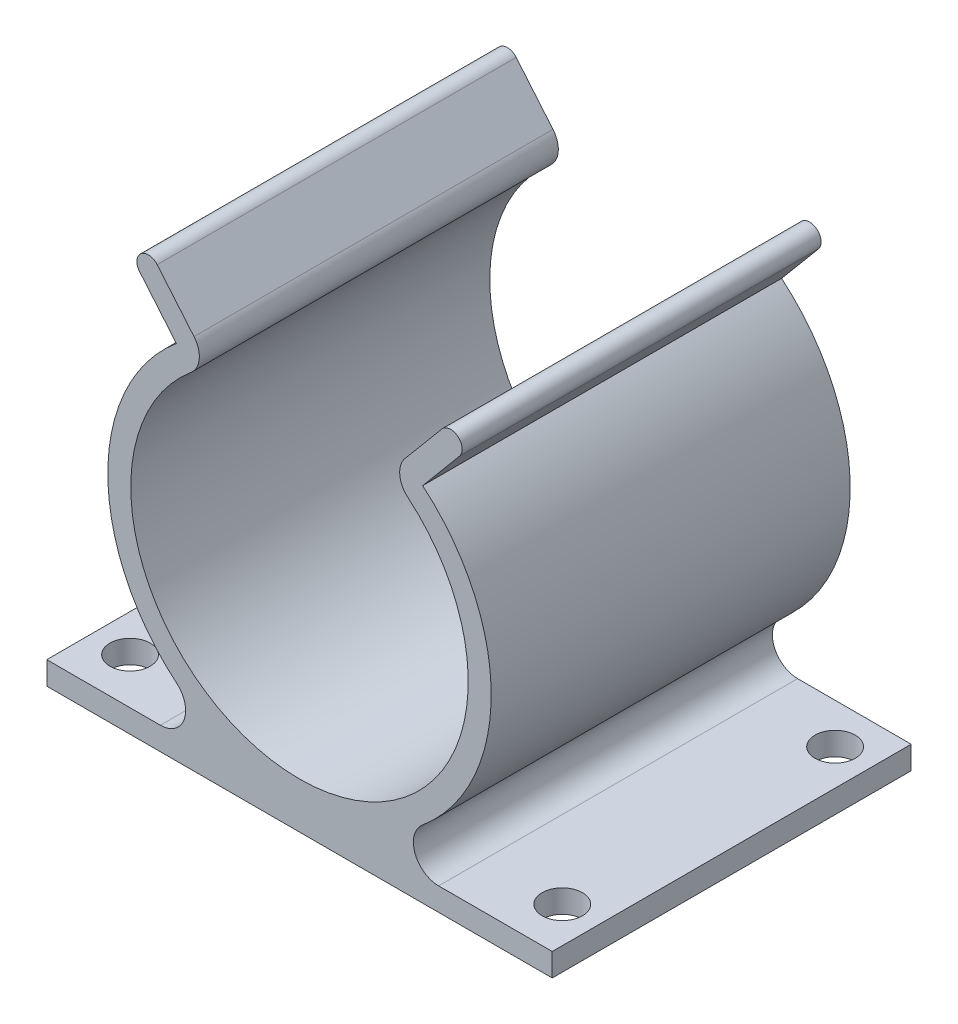
ISO-10303-21;
HEADER;
FILE_DESCRIPTION(('STEP AP214'),'2;1');
FILE_NAME('part.step','',(''),(''),'','','');
FILE_SCHEMA(('AUTOMOTIVE_DESIGN { 1 0 10303 214 1 1 1 1 }'));
ENDSEC;
DATA;
#1=APPLICATION_CONTEXT('core data for automotive mechanical design processes');
#2=APPLICATION_PROTOCOL_DEFINITION('international standard','automotive_design',2000,#1);
#3=PRODUCT_CONTEXT('',#1,'mechanical');
#4=PRODUCT('Part','Part','',(#3));
#5=PRODUCT_RELATED_PRODUCT_CATEGORY('part','',(#4));
#6=PRODUCT_DEFINITION_FORMATION('','',#4);
#7=PRODUCT_DEFINITION_CONTEXT('part definition',#1,'design');
#8=PRODUCT_DEFINITION('design','',#6,#7);
#9=PRODUCT_DEFINITION_SHAPE('','',#8);
#10=(LENGTH_UNIT() NAMED_UNIT(*) SI_UNIT(.MILLI.,.METRE.));
#11=(NAMED_UNIT(*) PLANE_ANGLE_UNIT() SI_UNIT($,.RADIAN.));
#12=(NAMED_UNIT(*) SI_UNIT($,.STERADIAN.) SOLID_ANGLE_UNIT());
#13=UNCERTAINTY_MEASURE_WITH_UNIT(LENGTH_MEASURE(1.E-05),#10,'distance_accuracy_value','');
#14=(GEOMETRIC_REPRESENTATION_CONTEXT(3) GLOBAL_UNCERTAINTY_ASSIGNED_CONTEXT((#13)) GLOBAL_UNIT_ASSIGNED_CONTEXT((#10,
#11,#12)) REPRESENTATION_CONTEXT('',''));
#15=CARTESIAN_POINT('',(0.,0.,0.));
#16=DIRECTION('',(0.,0.,1.));
#17=DIRECTION('',(1.,0.,0.));
#18=AXIS2_PLACEMENT_3D('',#15,#16,#17);
#19=CARTESIAN_POINT('',(17.6,0.8,25.));
#20=DIRECTION('',(-1.,0.,0.));
#21=DIRECTION('',(0.,0.,1.));
#22=AXIS2_PLACEMENT_3D('',#19,#20,#21);
#23=PLANE('',#22);
#24=DIRECTION('',(0.,1.,0.));
#25=VECTOR('',#24,1.);
#26=CARTESIAN_POINT('',(17.6,0.8,0.));
#27=LINE('',#26,#25);
#28=CARTESIAN_POINT('',(17.6,-0.8,0.));
#29=VERTEX_POINT('',#28);
#30=CARTESIAN_POINT('',(17.6,0.8,0.));
#31=VERTEX_POINT('',#30);
#32=EDGE_CURVE('E191',#29,#31,#27,.T.);
#33=ORIENTED_EDGE('',*,*,#32,.T.);
#34=DIRECTION('',(0.,0.,-1.));
#35=VECTOR('',#34,1.);
#36=CARTESIAN_POINT('',(17.6,0.8,25.));
#37=LINE('',#36,#35);
#38=CARTESIAN_POINT('',(17.6,0.8,25.));
#39=VERTEX_POINT('',#38);
#40=EDGE_CURVE('E11',#39,#31,#37,.T.);
#41=ORIENTED_EDGE('',*,*,#40,.F.);
#42=DIRECTION('',(0.,1.,0.));
#43=VECTOR('',#42,1.);
#44=CARTESIAN_POINT('',(17.6,0.8,25.));
#45=LINE('',#44,#43);
#46=CARTESIAN_POINT('',(17.6,-0.8,25.));
#47=VERTEX_POINT('',#46);
#48=EDGE_CURVE('E226',#47,#39,#45,.T.);
#49=ORIENTED_EDGE('',*,*,#48,.F.);
#50=DIRECTION('',(0.,0.,-1.));
#51=VECTOR('',#50,1.);
#52=CARTESIAN_POINT('',(17.6,-0.8,25.));
#53=LINE('',#52,#51);
#54=EDGE_CURVE('E187',#47,#29,#53,.T.);
#55=ORIENTED_EDGE('',*,*,#54,.T.);
#56=EDGE_LOOP('',(#33,#41,#49,#55));
#57=FACE_BOUND('',#56,.T.);
#58=ADVANCED_FACE('F35',(#57),#23,.F.);
#59=CARTESIAN_POINT('',(9.68883892429772,0.8,25.));
#60=DIRECTION('',(0.,-1.,0.));
#61=DIRECTION('',(1.,0.,0.));
#62=AXIS2_PLACEMENT_3D('',#59,#60,#61);
#63=PLANE('',#62);
#64=CARTESIAN_POINT('',(15.1,0.800000000000002,2.8));
#65=DIRECTION('',(0.,-1.,0.));
#66=DIRECTION('',(1.,0.,0.));
#67=AXIS2_PLACEMENT_3D('',#64,#65,#66);
#68=CIRCLE('',#67,1.4);
#69=CARTESIAN_POINT('',(16.5,0.800000000000002,2.8));
#70=VERTEX_POINT('',#69);
#71=EDGE_CURVE('E417',#70,#70,#68,.F.);
#72=ORIENTED_EDGE('',*,*,#71,.F.);
#73=EDGE_LOOP('',(#72));
#74=FACE_BOUND('',#73,.T.);
#75=CARTESIAN_POINT('',(15.1,0.800000000000002,21.8));
#76=DIRECTION('',(0.,-1.,0.));
#77=DIRECTION('',(1.,0.,0.));
#78=AXIS2_PLACEMENT_3D('',#75,#76,#77);
#79=CIRCLE('',#78,1.4);
#80=CARTESIAN_POINT('',(16.5,0.800000000000002,21.8));
#81=VERTEX_POINT('',#80);
#82=EDGE_CURVE('E403',#81,#81,#79,.F.);
#83=ORIENTED_EDGE('',*,*,#82,.F.);
#84=EDGE_LOOP('',(#83));
#85=FACE_BOUND('',#84,.T.);
#86=DIRECTION('',(-1.,0.,0.));
#87=VECTOR('',#86,1.);
#88=CARTESIAN_POINT('',(9.68883892429772,0.8,0.));
#89=LINE('',#88,#87);
#90=CARTESIAN_POINT('',(9.68883892429772,0.800000000000002,0.));
#91=VERTEX_POINT('',#90);
#92=EDGE_CURVE('E194',#31,#91,#89,.T.);
#93=ORIENTED_EDGE('',*,*,#92,.T.);
#94=DIRECTION('',(0.,0.,-1.));
#95=VECTOR('',#94,1.);
#96=CARTESIAN_POINT('',(9.68883892429772,0.800000000000002,25.));
#97=LINE('',#96,#95);
#98=CARTESIAN_POINT('',(9.68883892429772,0.800000000000002,25.));
#99=VERTEX_POINT('',#98);
#100=EDGE_CURVE('E43',#99,#91,#97,.T.);
#101=ORIENTED_EDGE('',*,*,#100,.F.);
#102=DIRECTION('',(-1.,0.,0.));
#103=VECTOR('',#102,1.);
#104=CARTESIAN_POINT('',(9.68883892429772,0.8,25.));
#105=LINE('',#104,#103);
#106=EDGE_CURVE('E124',#39,#99,#105,.T.);
#107=ORIENTED_EDGE('',*,*,#106,.F.);
#108=ORIENTED_EDGE('',*,*,#40,.T.);
#109=EDGE_LOOP('',(#93,#101,#107,#108));
#110=FACE_BOUND('',#109,.T.);
#111=ADVANCED_FACE('F337',(#74,#85,#110),#63,.F.);
#112=CARTESIAN_POINT('',(9.68883892429772,2.55793257867016,25.));
#113=DIRECTION('',(0.,0.,-1.));
#114=DIRECTION('',(-1.,0.,0.));
#115=AXIS2_PLACEMENT_3D('',#112,#113,#114);
#116=CYLINDRICAL_SURFACE('',#115,1.75793257867016);
#117=CARTESIAN_POINT('',(9.68883892429772,2.55793257867016,0.));
#118=DIRECTION('',(0.,0.,-1.));
#119=DIRECTION('',(1.,0.,0.));
#120=AXIS2_PLACEMENT_3D('',#117,#118,#119);
#121=CIRCLE('',#120,1.75793257867016);
#122=CARTESIAN_POINT('',(8.56146259363039,3.90676524442265,0.));
#123=VERTEX_POINT('',#122);
#124=EDGE_CURVE('E197',#91,#123,#121,.T.);
#125=ORIENTED_EDGE('',*,*,#124,.T.);
#126=DIRECTION('',(0.,0.,-1.));
#127=VECTOR('',#126,1.);
#128=CARTESIAN_POINT('',(8.56146259363039,3.90676524442265,25.));
#129=LINE('',#128,#127);
#130=CARTESIAN_POINT('',(8.56146259363039,3.90676524442265,25.));
#131=VERTEX_POINT('',#130);
#132=EDGE_CURVE('E263',#131,#123,#129,.T.);
#133=ORIENTED_EDGE('',*,*,#132,.F.);
#134=CARTESIAN_POINT('',(9.68883892429772,2.55793257867016,25.));
#135=DIRECTION('',(0.,0.,-1.));
#136=DIRECTION('',(1.,0.,0.));
#137=AXIS2_PLACEMENT_3D('',#134,#135,#136);
#138=CIRCLE('',#137,1.75793257867016);
#139=EDGE_CURVE('E271',#99,#131,#138,.T.);
#140=ORIENTED_EDGE('',*,*,#139,.F.);
#141=ORIENTED_EDGE('',*,*,#100,.T.);
#142=EDGE_LOOP('',(#125,#133,#140,#141));
#143=FACE_BOUND('',#142,.T.);
#144=ADVANCED_FACE('F269',(#143),#116,.F.);
#145=CARTESIAN_POINT('',(0.,14.15,25.));
#146=DIRECTION('',(0.,0.,-1.));
#147=DIRECTION('',(-1.,0.,0.));
#148=AXIS2_PLACEMENT_3D('',#145,#146,#147);
#149=CYLINDRICAL_SURFACE('',#148,13.35);
#150=CARTESIAN_POINT('',(0.,14.15,0.));
#151=DIRECTION('',(0.,0.,1.));
#152=DIRECTION('',(1.,0.,0.));
#153=AXIS2_PLACEMENT_3D('',#150,#151,#152);
#154=CIRCLE('',#153,13.35);
#155=CARTESIAN_POINT('',(8.57535179867474,24.3816099187257,0.));
#156=VERTEX_POINT('',#155);
#157=EDGE_CURVE('E199',#123,#156,#154,.T.);
#158=ORIENTED_EDGE('',*,*,#157,.T.);
#159=DIRECTION('',(0.,0.,-1.));
#160=VECTOR('',#159,1.);
#161=CARTESIAN_POINT('',(8.57535179867474,24.3816099187257,25.));
#162=LINE('',#161,#160);
#163=CARTESIAN_POINT('',(8.57535179867474,24.3816099187257,25.));
#164=VERTEX_POINT('',#163);
#165=EDGE_CURVE('E260',#164,#156,#162,.T.);
#166=ORIENTED_EDGE('',*,*,#165,.F.);
#167=CARTESIAN_POINT('',(0.,14.15,25.));
#168=DIRECTION('',(0.,0.,1.));
#169=DIRECTION('',(1.,0.,0.));
#170=AXIS2_PLACEMENT_3D('',#167,#168,#169);
#171=CIRCLE('',#170,13.35);
#172=EDGE_CURVE('E289',#131,#164,#171,.T.);
#173=ORIENTED_EDGE('',*,*,#172,.F.);
#174=ORIENTED_EDGE('',*,*,#132,.T.);
#175=EDGE_LOOP('',(#158,#166,#173,#174));
#176=FACE_BOUND('',#175,.T.);
#177=ADVANCED_FACE('F280',(#176),#149,.T.);
#178=CARTESIAN_POINT('',(8.57535179867474,24.3816099187257,25.));
#179=DIRECTION('',(-0.766412727994434,0.642348449338932,0.));
#180=DIRECTION('',(-0.642348449338932,-0.766412727994434,0.));
#181=AXIS2_PLACEMENT_3D('',#178,#179,#180);
#182=PLANE('',#181);
#183=DIRECTION('',(0.642348449338932,0.766412727994434,0.));
#184=VECTOR('',#183,1.);
#185=CARTESIAN_POINT('',(8.57535179867474,24.3816099187257,0.));
#186=LINE('',#185,#184);
#187=CARTESIAN_POINT('',(11.1376085013992,27.4387452654025,0.));
#188=VERTEX_POINT('',#187);
#189=EDGE_CURVE('E201',#156,#188,#186,.T.);
#190=ORIENTED_EDGE('',*,*,#189,.T.);
#191=DIRECTION('',(0.,0.,-1.));
#192=VECTOR('',#191,1.);
#193=CARTESIAN_POINT('',(11.1376085013992,27.4387452654025,25.));
#194=LINE('',#193,#192);
#195=CARTESIAN_POINT('',(11.1376085013992,27.4387452654025,25.));
#196=VERTEX_POINT('',#195);
#197=EDGE_CURVE('E257',#196,#188,#194,.T.);
#198=ORIENTED_EDGE('',*,*,#197,.F.);
#199=DIRECTION('',(0.642348449338932,0.766412727994434,0.));
#200=VECTOR('',#199,1.);
#201=CARTESIAN_POINT('',(8.57535179867474,24.3816099187257,25.));
#202=LINE('',#201,#200);
#203=EDGE_CURVE('E286',#164,#196,#202,.T.);
#204=ORIENTED_EDGE('',*,*,#203,.F.);
#205=ORIENTED_EDGE('',*,*,#165,.T.);
#206=EDGE_LOOP('',(#190,#198,#204,#205));
#207=FACE_BOUND('',#206,.T.);
#208=ADVANCED_FACE('F284',(#207),#182,.F.);
#209=CARTESIAN_POINT('',(10.5244783190037,27.9526240248736,25.));
#210=DIRECTION('',(0.,0.,-1.));
#211=DIRECTION('',(-1.,0.,0.));
#212=AXIS2_PLACEMENT_3D('',#209,#210,#211);
#213=CYLINDRICAL_SURFACE('',#212,0.8);
#214=CARTESIAN_POINT('',(10.5244783190037,27.9526240248736,0.));
#215=DIRECTION('',(0.,0.,1.));
#216=DIRECTION('',(1.,0.,0.));
#217=AXIS2_PLACEMENT_3D('',#214,#215,#216);
#218=CIRCLE('',#217,0.8);
#219=CARTESIAN_POINT('',(9.91134813660811,28.4665027843448,0.));
#220=VERTEX_POINT('',#219);
#221=EDGE_CURVE('E203',#188,#220,#218,.T.);
#222=ORIENTED_EDGE('',*,*,#221,.T.);
#223=DIRECTION('',(0.,0.,-1.));
#224=VECTOR('',#223,1.);
#225=CARTESIAN_POINT('',(9.91134813660811,28.4665027843448,25.));
#226=LINE('',#225,#224);
#227=CARTESIAN_POINT('',(9.91134813660811,28.4665027843448,25.));
#228=VERTEX_POINT('',#227);
#229=EDGE_CURVE('E254',#228,#220,#226,.T.);
#230=ORIENTED_EDGE('',*,*,#229,.F.);
#231=CARTESIAN_POINT('',(10.5244783190037,27.9526240248736,25.));
#232=DIRECTION('',(0.,0.,1.));
#233=DIRECTION('',(1.,0.,0.));
#234=AXIS2_PLACEMENT_3D('',#231,#232,#233);
#235=CIRCLE('',#234,0.8);
#236=EDGE_CURVE('E288',#196,#228,#235,.T.);
#237=ORIENTED_EDGE('',*,*,#236,.F.);
#238=ORIENTED_EDGE('',*,*,#197,.T.);
#239=EDGE_LOOP('',(#222,#230,#237,#238));
#240=FACE_BOUND('',#239,.T.);
#241=ADVANCED_FACE('F353',(#240),#213,.T.);
#242=CARTESIAN_POINT('',(7.34909143388366,25.409367437668,25.));
#243=DIRECTION('',(0.766412727994437,-0.642348449338927,0.));
#244=DIRECTION('',(0.642348449338927,0.766412727994437,0.));
#245=AXIS2_PLACEMENT_3D('',#242,#243,#244);
#246=PLANE('',#245);
#247=DIRECTION('',(-0.642348449338927,-0.766412727994437,0.));
#248=VECTOR('',#247,1.);
#249=CARTESIAN_POINT('',(7.34909143388366,25.409367437668,0.));
#250=LINE('',#249,#248);
#251=CARTESIAN_POINT('',(7.34909143388366,25.409367437668,0.));
#252=VERTEX_POINT('',#251);
#253=EDGE_CURVE('E205',#220,#252,#250,.T.);
#254=ORIENTED_EDGE('',*,*,#253,.T.);
#255=DIRECTION('',(0.,0.,-1.));
#256=VECTOR('',#255,1.);
#257=CARTESIAN_POINT('',(7.34909143388366,25.409367437668,25.));
#258=LINE('',#257,#256);
#259=CARTESIAN_POINT('',(7.34909143388366,25.409367437668,25.));
#260=VERTEX_POINT('',#259);
#261=EDGE_CURVE('E251',#260,#252,#258,.T.);
#262=ORIENTED_EDGE('',*,*,#261,.F.);
#263=DIRECTION('',(-0.642348449338927,-0.766412727994437,0.));
#264=VECTOR('',#263,1.);
#265=CARTESIAN_POINT('',(7.34909143388366,25.409367437668,25.));
#266=LINE('',#265,#264);
#267=EDGE_CURVE('E291',#228,#260,#266,.T.);
#268=ORIENTED_EDGE('',*,*,#267,.F.);
#269=ORIENTED_EDGE('',*,*,#229,.T.);
#270=EDGE_LOOP('',(#254,#262,#268,#269));
#271=FACE_BOUND('',#270,.T.);
#272=ADVANCED_FACE('F356',(#271),#246,.F.);
#273=CARTESIAN_POINT('',(8.57535179867475,24.3816099187257,25.));
#274=DIRECTION('',(0.,0.,-1.));
#275=DIRECTION('',(-1.,0.,0.));
#276=AXIS2_PLACEMENT_3D('',#273,#274,#275);
#277=CYLINDRICAL_SURFACE('',#276,1.59999999999999);
#278=CARTESIAN_POINT('',(8.57535179867475,24.3816099187257,0.));
#279=DIRECTION('',(0.,0.,1.));
#280=DIRECTION('',(1.,0.,0.));
#281=AXIS2_PLACEMENT_3D('',#278,#279,#280);
#282=CIRCLE('',#281,1.59999999999999);
#283=CARTESIAN_POINT('',(7.54759427973245,23.1553495539346,0.));
#284=VERTEX_POINT('',#283);
#285=EDGE_CURVE('E207',#252,#284,#282,.T.);
#286=ORIENTED_EDGE('',*,*,#285,.T.);
#287=DIRECTION('',(0.,0.,-1.));
#288=VECTOR('',#287,1.);
#289=CARTESIAN_POINT('',(7.54759427973245,23.1553495539346,25.));
#290=LINE('',#289,#288);
#291=CARTESIAN_POINT('',(7.54759427973245,23.1553495539346,25.));
#292=VERTEX_POINT('',#291);
#293=EDGE_CURVE('E248',#292,#284,#290,.T.);
#294=ORIENTED_EDGE('',*,*,#293,.F.);
#295=CARTESIAN_POINT('',(8.57535179867475,24.3816099187257,25.));
#296=DIRECTION('',(0.,0.,1.));
#297=DIRECTION('',(1.,0.,0.));
#298=AXIS2_PLACEMENT_3D('',#295,#296,#297);
#299=CIRCLE('',#298,1.59999999999999);
#300=EDGE_CURVE('E297',#260,#292,#299,.T.);
#301=ORIENTED_EDGE('',*,*,#300,.F.);
#302=ORIENTED_EDGE('',*,*,#261,.T.);
#303=EDGE_LOOP('',(#286,#294,#301,#302));
#304=FACE_BOUND('',#303,.T.);
#305=ADVANCED_FACE('F360',(#304),#277,.T.);
#306=CARTESIAN_POINT('',(0.,14.15,25.));
#307=DIRECTION('',(0.,0.,-1.));
#308=DIRECTION('',(-1.,0.,0.));
#309=AXIS2_PLACEMENT_3D('',#306,#307,#308);
#310=CYLINDRICAL_SURFACE('',#309,11.75);
#311=CARTESIAN_POINT('',(0.,14.15,0.));
#312=DIRECTION('',(0.,0.,-1.));
#313=DIRECTION('',(1.,0.,0.));
#314=AXIS2_PLACEMENT_3D('',#311,#312,#313);
#315=CIRCLE('',#314,11.75);
#316=CARTESIAN_POINT('',(-7.54759427973245,23.1553495539346,0.));
#317=VERTEX_POINT('',#316);
#318=EDGE_CURVE('E209',#284,#317,#315,.T.);
#319=ORIENTED_EDGE('',*,*,#318,.T.);
#320=DIRECTION('',(0.,0.,-1.));
#321=VECTOR('',#320,1.);
#322=CARTESIAN_POINT('',(-7.54759427973245,23.1553495539346,25.));
#323=LINE('',#322,#321);
#324=CARTESIAN_POINT('',(-7.54759427973245,23.1553495539346,25.));
#325=VERTEX_POINT('',#324);
#326=EDGE_CURVE('E245',#325,#317,#323,.T.);
#327=ORIENTED_EDGE('',*,*,#326,.F.);
#328=CARTESIAN_POINT('',(0.,14.15,25.));
#329=DIRECTION('',(0.,0.,-1.));
#330=DIRECTION('',(1.,0.,0.));
#331=AXIS2_PLACEMENT_3D('',#328,#329,#330);
#332=CIRCLE('',#331,11.75);
#333=EDGE_CURVE('E299',#292,#325,#332,.T.);
#334=ORIENTED_EDGE('',*,*,#333,.F.);
#335=ORIENTED_EDGE('',*,*,#293,.T.);
#336=EDGE_LOOP('',(#319,#327,#334,#335));
#337=FACE_BOUND('',#336,.T.);
#338=ADVANCED_FACE('F364',(#337),#310,.F.);
#339=CARTESIAN_POINT('',(-8.57535179867475,24.3816099187257,25.));
#340=DIRECTION('',(0.,0.,-1.));
#341=DIRECTION('',(-1.,0.,0.));
#342=AXIS2_PLACEMENT_3D('',#339,#340,#341);
#343=CYLINDRICAL_SURFACE('',#342,1.60000000000001);
#344=CARTESIAN_POINT('',(-8.57535179867475,24.3816099187257,0.));
#345=DIRECTION('',(0.,0.,1.));
#346=DIRECTION('',(-1.,0.,0.));
#347=AXIS2_PLACEMENT_3D('',#344,#345,#346);
#348=CIRCLE('',#347,1.60000000000001);
#349=CARTESIAN_POINT('',(-7.34909143388364,25.409367437668,0.));
#350=VERTEX_POINT('',#349);
#351=EDGE_CURVE('E211',#317,#350,#348,.T.);
#352=ORIENTED_EDGE('',*,*,#351,.T.);
#353=DIRECTION('',(0.,0.,-1.));
#354=VECTOR('',#353,1.);
#355=CARTESIAN_POINT('',(-7.34909143388364,25.409367437668,25.));
#356=LINE('',#355,#354);
#357=CARTESIAN_POINT('',(-7.34909143388364,25.409367437668,25.));
#358=VERTEX_POINT('',#357);
#359=EDGE_CURVE('E242',#358,#350,#356,.T.);
#360=ORIENTED_EDGE('',*,*,#359,.F.);
#361=CARTESIAN_POINT('',(-8.57535179867475,24.3816099187257,25.));
#362=DIRECTION('',(0.,0.,1.));
#363=DIRECTION('',(-1.,0.,0.));
#364=AXIS2_PLACEMENT_3D('',#361,#362,#363);
#365=CIRCLE('',#364,1.60000000000001);
#366=EDGE_CURVE('E301',#325,#358,#365,.T.);
#367=ORIENTED_EDGE('',*,*,#366,.F.);
#368=ORIENTED_EDGE('',*,*,#326,.T.);
#369=EDGE_LOOP('',(#352,#360,#367,#368));
#370=FACE_BOUND('',#369,.T.);
#371=ADVANCED_FACE('F368',(#370),#343,.T.);
#372=CARTESIAN_POINT('',(-7.34909143388364,25.409367437668,25.));
#373=DIRECTION('',(-0.766412727994433,-0.642348449338932,0.));
#374=DIRECTION('',(0.642348449338932,-0.766412727994433,0.));
#375=AXIS2_PLACEMENT_3D('',#372,#373,#374);
#376=PLANE('',#375);
#377=DIRECTION('',(-0.642348449338932,0.766412727994433,0.));
#378=VECTOR('',#377,1.);
#379=CARTESIAN_POINT('',(-7.34909143388364,25.409367437668,0.));
#380=LINE('',#379,#378);
#381=CARTESIAN_POINT('',(-9.9113481366081,28.4665027843448,0.));
#382=VERTEX_POINT('',#381);
#383=EDGE_CURVE('E213',#350,#382,#380,.T.);
#384=ORIENTED_EDGE('',*,*,#383,.T.);
#385=DIRECTION('',(0.,0.,-1.));
#386=VECTOR('',#385,1.);
#387=CARTESIAN_POINT('',(-9.9113481366081,28.4665027843448,25.));
#388=LINE('',#387,#386);
#389=CARTESIAN_POINT('',(-9.9113481366081,28.4665027843448,25.));
#390=VERTEX_POINT('',#389);
#391=EDGE_CURVE('E239',#390,#382,#388,.T.);
#392=ORIENTED_EDGE('',*,*,#391,.F.);
#393=DIRECTION('',(-0.642348449338932,0.766412727994433,0.));
#394=VECTOR('',#393,1.);
#395=CARTESIAN_POINT('',(-7.34909143388364,25.409367437668,25.));
#396=LINE('',#395,#394);
#397=EDGE_CURVE('E303',#358,#390,#396,.T.);
#398=ORIENTED_EDGE('',*,*,#397,.F.);
#399=ORIENTED_EDGE('',*,*,#359,.T.);
#400=EDGE_LOOP('',(#384,#392,#398,#399));
#401=FACE_BOUND('',#400,.T.);
#402=ADVANCED_FACE('F372',(#401),#376,.F.);
#403=CARTESIAN_POINT('',(-10.5244783190037,27.9526240248736,25.));
#404=DIRECTION('',(0.,0.,-1.));
#405=DIRECTION('',(-1.,0.,0.));
#406=AXIS2_PLACEMENT_3D('',#403,#404,#405);
#407=CYLINDRICAL_SURFACE('',#406,0.800000000000007);
#408=CARTESIAN_POINT('',(-10.5244783190037,27.9526240248736,0.));
#409=DIRECTION('',(0.,0.,1.));
#410=DIRECTION('',(-1.,0.,0.));
#411=AXIS2_PLACEMENT_3D('',#408,#409,#410);
#412=CIRCLE('',#411,0.800000000000007);
#413=CARTESIAN_POINT('',(-11.1376085013992,27.4387452654025,0.));
#414=VERTEX_POINT('',#413);
#415=EDGE_CURVE('E215',#382,#414,#412,.T.);
#416=ORIENTED_EDGE('',*,*,#415,.T.);
#417=DIRECTION('',(0.,0.,-1.));
#418=VECTOR('',#417,1.);
#419=CARTESIAN_POINT('',(-11.1376085013992,27.4387452654025,25.));
#420=LINE('',#419,#418);
#421=CARTESIAN_POINT('',(-11.1376085013992,27.4387452654025,25.));
#422=VERTEX_POINT('',#421);
#423=EDGE_CURVE('E236',#422,#414,#420,.T.);
#424=ORIENTED_EDGE('',*,*,#423,.F.);
#425=CARTESIAN_POINT('',(-10.5244783190037,27.9526240248736,25.));
#426=DIRECTION('',(0.,0.,1.));
#427=DIRECTION('',(-1.,0.,0.));
#428=AXIS2_PLACEMENT_3D('',#425,#426,#427);
#429=CIRCLE('',#428,0.800000000000007);
#430=EDGE_CURVE('E305',#390,#422,#429,.T.);
#431=ORIENTED_EDGE('',*,*,#430,.F.);
#432=ORIENTED_EDGE('',*,*,#391,.T.);
#433=EDGE_LOOP('',(#416,#424,#431,#432));
#434=FACE_BOUND('',#433,.T.);
#435=ADVANCED_FACE('F376',(#434),#407,.T.);
#436=CARTESIAN_POINT('',(-8.57535179867475,24.3816099187257,25.));
#437=DIRECTION('',(0.766412727994434,0.642348449338932,0.));
#438=DIRECTION('',(-0.642348449338932,0.766412727994434,0.));
#439=AXIS2_PLACEMENT_3D('',#436,#437,#438);
#440=PLANE('',#439);
#441=DIRECTION('',(0.642348449338932,-0.766412727994434,0.));
#442=VECTOR('',#441,1.);
#443=CARTESIAN_POINT('',(-8.57535179867475,24.3816099187257,0.));
#444=LINE('',#443,#442);
#445=CARTESIAN_POINT('',(-8.57535179867475,24.3816099187257,0.));
#446=VERTEX_POINT('',#445);
#447=EDGE_CURVE('E217',#414,#446,#444,.T.);
#448=ORIENTED_EDGE('',*,*,#447,.T.);
#449=DIRECTION('',(0.,0.,-1.));
#450=VECTOR('',#449,1.);
#451=CARTESIAN_POINT('',(-8.57535179867475,24.3816099187257,25.));
#452=LINE('',#451,#450);
#453=CARTESIAN_POINT('',(-8.57535179867475,24.3816099187257,25.));
#454=VERTEX_POINT('',#453);
#455=EDGE_CURVE('E233',#454,#446,#452,.T.);
#456=ORIENTED_EDGE('',*,*,#455,.F.);
#457=DIRECTION('',(0.642348449338932,-0.766412727994434,0.));
#458=VECTOR('',#457,1.);
#459=CARTESIAN_POINT('',(-8.57535179867475,24.3816099187257,25.));
#460=LINE('',#459,#458);
#461=EDGE_CURVE('E307',#422,#454,#460,.T.);
#462=ORIENTED_EDGE('',*,*,#461,.F.);
#463=ORIENTED_EDGE('',*,*,#423,.T.);
#464=EDGE_LOOP('',(#448,#456,#462,#463));
#465=FACE_BOUND('',#464,.T.);
#466=ADVANCED_FACE('F380',(#465),#440,.F.);
#467=CARTESIAN_POINT('',(0.,14.15,25.));
#468=DIRECTION('',(0.,0.,-1.));
#469=DIRECTION('',(-1.,0.,0.));
#470=AXIS2_PLACEMENT_3D('',#467,#468,#469);
#471=CYLINDRICAL_SURFACE('',#470,13.35);
#472=CARTESIAN_POINT('',(0.,14.15,0.));
#473=DIRECTION('',(0.,0.,1.));
#474=DIRECTION('',(1.,0.,0.));
#475=AXIS2_PLACEMENT_3D('',#472,#473,#474);
#476=CIRCLE('',#475,13.35);
#477=CARTESIAN_POINT('',(-8.56146259363039,3.90676524442266,0.));
#478=VERTEX_POINT('',#477);
#479=EDGE_CURVE('E219',#446,#478,#476,.T.);
#480=ORIENTED_EDGE('',*,*,#479,.T.);
#481=DIRECTION('',(0.,0.,-1.));
#482=VECTOR('',#481,1.);
#483=CARTESIAN_POINT('',(-8.56146259363039,3.90676524442266,25.));
#484=LINE('',#483,#482);
#485=CARTESIAN_POINT('',(-8.56146259363039,3.90676524442266,25.));
#486=VERTEX_POINT('',#485);
#487=EDGE_CURVE('E230',#486,#478,#484,.T.);
#488=ORIENTED_EDGE('',*,*,#487,.F.);
#489=CARTESIAN_POINT('',(0.,14.15,25.));
#490=DIRECTION('',(0.,0.,1.));
#491=DIRECTION('',(1.,0.,0.));
#492=AXIS2_PLACEMENT_3D('',#489,#490,#491);
#493=CIRCLE('',#492,13.35);
#494=EDGE_CURVE('E309',#454,#486,#493,.T.);
#495=ORIENTED_EDGE('',*,*,#494,.F.);
#496=ORIENTED_EDGE('',*,*,#455,.T.);
#497=EDGE_LOOP('',(#480,#488,#495,#496));
#498=FACE_BOUND('',#497,.T.);
#499=ADVANCED_FACE('F315',(#498),#471,.T.);
#500=CARTESIAN_POINT('',(-9.68883892429772,2.55793257867016,25.));
#501=DIRECTION('',(0.,0.,-1.));
#502=DIRECTION('',(-1.,0.,0.));
#503=AXIS2_PLACEMENT_3D('',#500,#501,#502);
#504=CYLINDRICAL_SURFACE('',#503,1.75793257867016);
#505=CARTESIAN_POINT('',(-9.68883892429772,2.55793257867016,0.));
#506=DIRECTION('',(0.,0.,-1.));
#507=DIRECTION('',(1.,0.,0.));
#508=AXIS2_PLACEMENT_3D('',#505,#506,#507);
#509=CIRCLE('',#508,1.75793257867016);
#510=CARTESIAN_POINT('',(-9.68883892429772,0.8,0.));
#511=VERTEX_POINT('',#510);
#512=EDGE_CURVE('E221',#478,#511,#509,.T.);
#513=ORIENTED_EDGE('',*,*,#512,.T.);
#514=DIRECTION('',(0.,0.,-1.));
#515=VECTOR('',#514,1.);
#516=CARTESIAN_POINT('',(-9.68883892429772,0.8,25.));
#517=LINE('',#516,#515);
#518=CARTESIAN_POINT('',(-9.68883892429772,0.8,25.));
#519=VERTEX_POINT('',#518);
#520=EDGE_CURVE('E182',#519,#511,#517,.T.);
#521=ORIENTED_EDGE('',*,*,#520,.F.);
#522=CARTESIAN_POINT('',(-9.68883892429772,2.55793257867016,25.));
#523=DIRECTION('',(0.,0.,-1.));
#524=DIRECTION('',(1.,0.,0.));
#525=AXIS2_PLACEMENT_3D('',#522,#523,#524);
#526=CIRCLE('',#525,1.75793257867016);
#527=EDGE_CURVE('E173',#486,#519,#526,.T.);
#528=ORIENTED_EDGE('',*,*,#527,.F.);
#529=ORIENTED_EDGE('',*,*,#487,.T.);
#530=EDGE_LOOP('',(#513,#521,#528,#529));
#531=FACE_BOUND('',#530,.T.);
#532=ADVANCED_FACE('F319',(#531),#504,.F.);
#533=CARTESIAN_POINT('',(-17.6,0.8,25.));
#534=DIRECTION('',(0.,-1.,0.));
#535=DIRECTION('',(1.,0.,0.));
#536=AXIS2_PLACEMENT_3D('',#533,#534,#535);
#537=PLANE('',#536);
#538=CARTESIAN_POINT('',(-15.,0.799999999999999,2.8));
#539=DIRECTION('',(0.,-1.,0.));
#540=DIRECTION('',(1.,0.,0.));
#541=AXIS2_PLACEMENT_3D('',#538,#539,#540);
#542=CIRCLE('',#541,1.4);
#543=CARTESIAN_POINT('',(-13.6,0.799999999999999,2.8));
#544=VERTEX_POINT('',#543);
#545=EDGE_CURVE('E396',#544,#544,#542,.F.);
#546=ORIENTED_EDGE('',*,*,#545,.F.);
#547=EDGE_LOOP('',(#546));
#548=FACE_BOUND('',#547,.T.);
#549=CARTESIAN_POINT('',(-15.,0.799999999999999,21.8));
#550=DIRECTION('',(0.,-1.,0.));
#551=DIRECTION('',(1.,0.,0.));
#552=AXIS2_PLACEMENT_3D('',#549,#550,#551);
#553=CIRCLE('',#552,1.4);
#554=CARTESIAN_POINT('',(-13.6,0.799999999999999,21.8));
#555=VERTEX_POINT('',#554);
#556=EDGE_CURVE('E195',#555,#555,#553,.F.);
#557=ORIENTED_EDGE('',*,*,#556,.F.);
#558=EDGE_LOOP('',(#557));
#559=FACE_BOUND('',#558,.T.);
#560=DIRECTION('',(-1.,0.,0.));
#561=VECTOR('',#560,1.);
#562=CARTESIAN_POINT('',(-17.6,0.8,0.));
#563=LINE('',#562,#561);
#564=CARTESIAN_POINT('',(-17.6,0.8,0.));
#565=VERTEX_POINT('',#564);
#566=EDGE_CURVE('E181',#511,#565,#563,.T.);
#567=ORIENTED_EDGE('',*,*,#566,.T.);
#568=DIRECTION('',(0.,0.,-1.));
#569=VECTOR('',#568,1.);
#570=CARTESIAN_POINT('',(-17.6,0.8,25.));
#571=LINE('',#570,#569);
#572=CARTESIAN_POINT('',(-17.6,0.8,25.));
#573=VERTEX_POINT('',#572);
#574=EDGE_CURVE('E178',#573,#565,#571,.T.);
#575=ORIENTED_EDGE('',*,*,#574,.F.);
#576=DIRECTION('',(-1.,0.,0.));
#577=VECTOR('',#576,1.);
#578=CARTESIAN_POINT('',(-17.6,0.8,25.));
#579=LINE('',#578,#577);
#580=EDGE_CURVE('E167',#519,#573,#579,.T.);
#581=ORIENTED_EDGE('',*,*,#580,.F.);
#582=ORIENTED_EDGE('',*,*,#520,.T.);
#583=EDGE_LOOP('',(#567,#575,#581,#582));
#584=FACE_BOUND('',#583,.T.);
#585=ADVANCED_FACE('F179',(#548,#559,#584),#537,.F.);
#586=CARTESIAN_POINT('',(-17.6,0.8,25.));
#587=DIRECTION('',(1.,0.,0.));
#588=DIRECTION('',(0.,0.,-1.));
#589=AXIS2_PLACEMENT_3D('',#586,#587,#588);
#590=PLANE('',#589);
#591=DIRECTION('',(0.,-1.,0.));
#592=VECTOR('',#591,1.);
#593=CARTESIAN_POINT('',(-17.6,0.8,0.));
#594=LINE('',#593,#592);
#595=CARTESIAN_POINT('',(-17.6,-0.8,0.));
#596=VERTEX_POINT('',#595);
#597=EDGE_CURVE('E110',#565,#596,#594,.T.);
#598=ORIENTED_EDGE('',*,*,#597,.T.);
#599=DIRECTION('',(0.,0.,-1.));
#600=VECTOR('',#599,1.);
#601=CARTESIAN_POINT('',(-17.6,-0.8,25.));
#602=LINE('',#601,#600);
#603=CARTESIAN_POINT('',(-17.6,-0.8,25.));
#604=VERTEX_POINT('',#603);
#605=EDGE_CURVE('E183',#604,#596,#602,.T.);
#606=ORIENTED_EDGE('',*,*,#605,.F.);
#607=DIRECTION('',(0.,-1.,0.));
#608=VECTOR('',#607,1.);
#609=CARTESIAN_POINT('',(-17.6,0.8,25.));
#610=LINE('',#609,#608);
#611=EDGE_CURVE('E171',#573,#604,#610,.T.);
#612=ORIENTED_EDGE('',*,*,#611,.F.);
#613=ORIENTED_EDGE('',*,*,#574,.T.);
#614=EDGE_LOOP('',(#598,#606,#612,#613));
#615=FACE_BOUND('',#614,.T.);
#616=ADVANCED_FACE('F185',(#615),#590,.F.);
#617=CARTESIAN_POINT('',(-17.6,-0.8,25.));
#618=DIRECTION('',(0.,1.,0.));
#619=DIRECTION('',(0.,0.,1.));
#620=AXIS2_PLACEMENT_3D('',#617,#618,#619);
#621=PLANE('',#620);
#622=CARTESIAN_POINT('',(15.1,-0.8,2.8));
#623=DIRECTION('',(0.,-1.,0.));
#624=DIRECTION('',(0.,0.,-1.));
#625=AXIS2_PLACEMENT_3D('',#622,#623,#624);
#626=CIRCLE('',#625,1.4);
#627=CARTESIAN_POINT('',(15.1,-0.8,1.4));
#628=VERTEX_POINT('',#627);
#629=EDGE_CURVE('E420',#628,#628,#626,.T.);
#630=ORIENTED_EDGE('',*,*,#629,.F.);
#631=EDGE_LOOP('',(#630));
#632=FACE_BOUND('',#631,.T.);
#633=CARTESIAN_POINT('',(-15.,-0.8,2.8));
#634=DIRECTION('',(0.,-1.,0.));
#635=DIRECTION('',(0.,0.,-1.));
#636=AXIS2_PLACEMENT_3D('',#633,#634,#635);
#637=CIRCLE('',#636,1.4);
#638=CARTESIAN_POINT('',(-15.,-0.8,1.4));
#639=VERTEX_POINT('',#638);
#640=EDGE_CURVE('E414',#639,#639,#637,.T.);
#641=ORIENTED_EDGE('',*,*,#640,.F.);
#642=EDGE_LOOP('',(#641));
#643=FACE_BOUND('',#642,.T.);
#644=CARTESIAN_POINT('',(15.1,-0.8,21.8));
#645=DIRECTION('',(0.,-1.,0.));
#646=DIRECTION('',(0.,0.,-1.));
#647=AXIS2_PLACEMENT_3D('',#644,#645,#646);
#648=CIRCLE('',#647,1.4);
#649=CARTESIAN_POINT('',(15.1,-0.8,20.4));
#650=VERTEX_POINT('',#649);
#651=EDGE_CURVE('E410',#650,#650,#648,.T.);
#652=ORIENTED_EDGE('',*,*,#651,.F.);
#653=EDGE_LOOP('',(#652));
#654=FACE_BOUND('',#653,.T.);
#655=CARTESIAN_POINT('',(-15.,-0.8,21.8));
#656=DIRECTION('',(0.,-1.,0.));
#657=DIRECTION('',(0.,0.,-1.));
#658=AXIS2_PLACEMENT_3D('',#655,#656,#657);
#659=CIRCLE('',#658,1.4);
#660=CARTESIAN_POINT('',(-15.,-0.8,20.4));
#661=VERTEX_POINT('',#660);
#662=EDGE_CURVE('E400',#661,#661,#659,.T.);
#663=ORIENTED_EDGE('',*,*,#662,.F.);
#664=EDGE_LOOP('',(#663));
#665=FACE_BOUND('',#664,.T.);
#666=DIRECTION('',(1.,0.,0.));
#667=VECTOR('',#666,1.);
#668=CARTESIAN_POINT('',(-17.6,-0.8,0.));
#669=LINE('',#668,#667);
#670=EDGE_CURVE('E116',#596,#29,#669,.T.);
#671=ORIENTED_EDGE('',*,*,#670,.T.);
#672=ORIENTED_EDGE('',*,*,#54,.F.);
#673=DIRECTION('',(1.,0.,0.));
#674=VECTOR('',#673,1.);
#675=CARTESIAN_POINT('',(-17.6,-0.8,25.));
#676=LINE('',#675,#674);
#677=EDGE_CURVE('E51',#604,#47,#676,.T.);
#678=ORIENTED_EDGE('',*,*,#677,.F.);
#679=ORIENTED_EDGE('',*,*,#605,.T.);
#680=EDGE_LOOP('',(#671,#672,#678,#679));
#681=FACE_BOUND('',#680,.T.);
#682=ADVANCED_FACE('F323',(#632,#643,#654,#665,#681),#621,.F.);
#683=CARTESIAN_POINT('',(-9.68883892429772,2.55793257867016,25.));
#684=DIRECTION('',(0.,0.,1.));
#685=DIRECTION('',(1.,0.,0.));
#686=AXIS2_PLACEMENT_3D('',#683,#684,#685);
#687=PLANE('',#686);
#688=ORIENTED_EDGE('',*,*,#48,.T.);
#689=ORIENTED_EDGE('',*,*,#106,.T.);
#690=ORIENTED_EDGE('',*,*,#139,.T.);
#691=ORIENTED_EDGE('',*,*,#172,.T.);
#692=ORIENTED_EDGE('',*,*,#203,.T.);
#693=ORIENTED_EDGE('',*,*,#236,.T.);
#694=ORIENTED_EDGE('',*,*,#267,.T.);
#695=ORIENTED_EDGE('',*,*,#300,.T.);
#696=ORIENTED_EDGE('',*,*,#333,.T.);
#697=ORIENTED_EDGE('',*,*,#366,.T.);
#698=ORIENTED_EDGE('',*,*,#397,.T.);
#699=ORIENTED_EDGE('',*,*,#430,.T.);
#700=ORIENTED_EDGE('',*,*,#461,.T.);
#701=ORIENTED_EDGE('',*,*,#494,.T.);
#702=ORIENTED_EDGE('',*,*,#527,.T.);
#703=ORIENTED_EDGE('',*,*,#580,.T.);
#704=ORIENTED_EDGE('',*,*,#611,.T.);
#705=ORIENTED_EDGE('',*,*,#677,.T.);
#706=EDGE_LOOP('',(#688,#689,#690,#691,#692,#693,#694,#695,#696,#697,#698,#699,#700,#701,#702,
#703,#704,#705));
#707=FACE_BOUND('',#706,.T.);
#708=ADVANCED_FACE('F169',(#707),#687,.T.);
#709=CARTESIAN_POINT('',(-9.68883892429772,2.55793257867016,0.));
#710=DIRECTION('',(0.,0.,1.));
#711=DIRECTION('',(1.,0.,0.));
#712=AXIS2_PLACEMENT_3D('',#709,#710,#711);
#713=PLANE('',#712);
#714=ORIENTED_EDGE('',*,*,#32,.F.);
#715=ORIENTED_EDGE('',*,*,#670,.F.);
#716=ORIENTED_EDGE('',*,*,#597,.F.);
#717=ORIENTED_EDGE('',*,*,#566,.F.);
#718=ORIENTED_EDGE('',*,*,#512,.F.);
#719=ORIENTED_EDGE('',*,*,#479,.F.);
#720=ORIENTED_EDGE('',*,*,#447,.F.);
#721=ORIENTED_EDGE('',*,*,#415,.F.);
#722=ORIENTED_EDGE('',*,*,#383,.F.);
#723=ORIENTED_EDGE('',*,*,#351,.F.);
#724=ORIENTED_EDGE('',*,*,#318,.F.);
#725=ORIENTED_EDGE('',*,*,#285,.F.);
#726=ORIENTED_EDGE('',*,*,#253,.F.);
#727=ORIENTED_EDGE('',*,*,#221,.F.);
#728=ORIENTED_EDGE('',*,*,#189,.F.);
#729=ORIENTED_EDGE('',*,*,#157,.F.);
#730=ORIENTED_EDGE('',*,*,#124,.F.);
#731=ORIENTED_EDGE('',*,*,#92,.F.);
#732=EDGE_LOOP('',(#714,#715,#716,#717,#718,#719,#720,#721,#722,#723,#724,#725,#726,#727,#728,
#729,#730,#731));
#733=FACE_BOUND('',#732,.T.);
#734=ADVANCED_FACE('F275',(#733),#713,.F.);
#735=CARTESIAN_POINT('',(-15.,28.7536240248737,21.8));
#736=DIRECTION('',(0.,-1.,0.));
#737=DIRECTION('',(0.,0.,-1.));
#738=AXIS2_PLACEMENT_3D('',#735,#736,#737);
#739=CYLINDRICAL_SURFACE('',#738,1.4);
#740=ORIENTED_EDGE('',*,*,#662,.T.);
#741=EDGE_LOOP('',(#740));
#742=FACE_BOUND('',#741,.T.);
#743=ORIENTED_EDGE('',*,*,#556,.T.);
#744=EDGE_LOOP('',(#743));
#745=FACE_BOUND('',#744,.T.);
#746=ADVANCED_FACE('F437',(#742,#745),#739,.F.);
#747=CARTESIAN_POINT('',(15.1,28.7536240248737,21.8));
#748=DIRECTION('',(0.,-1.,0.));
#749=DIRECTION('',(0.,0.,-1.));
#750=AXIS2_PLACEMENT_3D('',#747,#748,#749);
#751=CYLINDRICAL_SURFACE('',#750,1.4);
#752=ORIENTED_EDGE('',*,*,#651,.T.);
#753=EDGE_LOOP('',(#752));
#754=FACE_BOUND('',#753,.T.);
#755=ORIENTED_EDGE('',*,*,#82,.T.);
#756=EDGE_LOOP('',(#755));
#757=FACE_BOUND('',#756,.T.);
#758=ADVANCED_FACE('F431',(#754,#757),#751,.F.);
#759=CARTESIAN_POINT('',(-15.,28.7536240248737,2.8));
#760=DIRECTION('',(0.,-1.,0.));
#761=DIRECTION('',(0.,0.,-1.));
#762=AXIS2_PLACEMENT_3D('',#759,#760,#761);
#763=CYLINDRICAL_SURFACE('',#762,1.4);
#764=ORIENTED_EDGE('',*,*,#640,.T.);
#765=EDGE_LOOP('',(#764));
#766=FACE_BOUND('',#765,.T.);
#767=ORIENTED_EDGE('',*,*,#545,.T.);
#768=EDGE_LOOP('',(#767));
#769=FACE_BOUND('',#768,.T.);
#770=ADVANCED_FACE('F426',(#766,#769),#763,.F.);
#771=CARTESIAN_POINT('',(15.1,28.7536240248737,2.8));
#772=DIRECTION('',(0.,-1.,0.));
#773=DIRECTION('',(0.,0.,-1.));
#774=AXIS2_PLACEMENT_3D('',#771,#772,#773);
#775=CYLINDRICAL_SURFACE('',#774,1.4);
#776=ORIENTED_EDGE('',*,*,#629,.T.);
#777=EDGE_LOOP('',(#776));
#778=FACE_BOUND('',#777,.T.);
#779=ORIENTED_EDGE('',*,*,#71,.T.);
#780=EDGE_LOOP('',(#779));
#781=FACE_BOUND('',#780,.T.);
#782=ADVANCED_FACE('F423',(#778,#781),#775,.F.);
#783=CLOSED_SHELL('',(#58,#111,#144,#177,#208,#241,#272,#305,#338,#371,#402,#435,#466,#499,#532,
#585,#616,#682,#708,#734,#746,#758,#770,#782));
#784=MANIFOLD_SOLID_BREP('B2',#783);
#785=ADVANCED_BREP_SHAPE_REPRESENTATION('',(#18,#784),#14);
#786=SHAPE_DEFINITION_REPRESENTATION(#9,#785);
ENDSEC;
END-ISO-10303-21;
